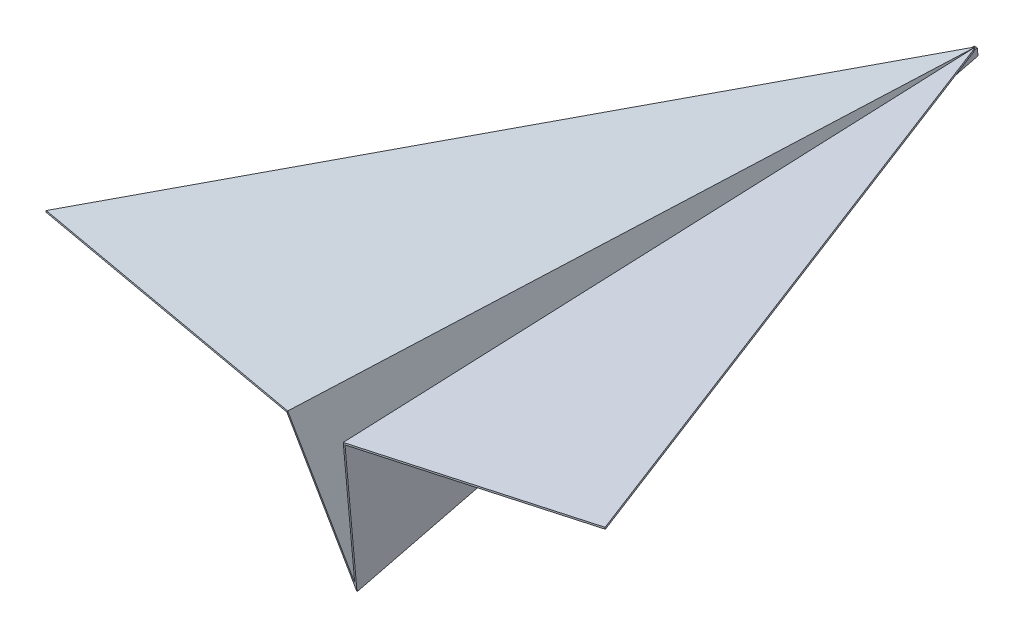
ISO-10303-21;
HEADER;
FILE_DESCRIPTION(('STEP AP214'),'2;1');
FILE_NAME('part.step','',(''),(''),'','','');
FILE_SCHEMA(('AUTOMOTIVE_DESIGN { 1 0 10303 214 1 1 1 1 }'));
ENDSEC;
DATA;
#1=APPLICATION_CONTEXT('core data for automotive mechanical design processes');
#2=APPLICATION_PROTOCOL_DEFINITION('international standard','automotive_design',2000,#1);
#3=PRODUCT_CONTEXT('',#1,'mechanical');
#4=PRODUCT('Part','Part','',(#3));
#5=PRODUCT_RELATED_PRODUCT_CATEGORY('part','',(#4));
#6=PRODUCT_DEFINITION_FORMATION('','',#4);
#7=PRODUCT_DEFINITION_CONTEXT('part definition',#1,'design');
#8=PRODUCT_DEFINITION('design','',#6,#7);
#9=PRODUCT_DEFINITION_SHAPE('','',#8);
#10=(LENGTH_UNIT() NAMED_UNIT(*) SI_UNIT(.MILLI.,.METRE.));
#11=(NAMED_UNIT(*) PLANE_ANGLE_UNIT() SI_UNIT($,.RADIAN.));
#12=(NAMED_UNIT(*) SI_UNIT($,.STERADIAN.) SOLID_ANGLE_UNIT());
#13=UNCERTAINTY_MEASURE_WITH_UNIT(LENGTH_MEASURE(1.E-05),#10,'distance_accuracy_value','');
#14=(GEOMETRIC_REPRESENTATION_CONTEXT(3) GLOBAL_UNCERTAINTY_ASSIGNED_CONTEXT((#13)) GLOBAL_UNIT_ASSIGNED_CONTEXT((#10,
#11,#12)) REPRESENTATION_CONTEXT('',''));
#15=CARTESIAN_POINT('',(0.,0.,0.));
#16=DIRECTION('',(0.,0.,1.));
#17=DIRECTION('',(1.,0.,0.));
#18=AXIS2_PLACEMENT_3D('',#15,#16,#17);
#19=CARTESIAN_POINT('',(86.9910760611707,14.8972842107196,202.757548833242));
#20=DIRECTION('',(0.900802991421506,0.171191018769699,-0.399058398907551));
#21=DIRECTION('',(-0.393387244085793,-0.0673678478916255,-0.916901330166467));
#22=AXIS2_PLACEMENT_3D('',#19,#20,#21);
#23=PLANE('',#22);
#24=DIRECTION('',(-0.413760082318396,0.0595692070179401,-0.908434975028553));
#25=VECTOR('',#24,1.);
#26=CARTESIAN_POINT('',(90.7367850940264,-13.0634117847286,199.218031471757));
#27=LINE('',#26,#25);
#28=CARTESIAN_POINT('',(0.,0.,0.));
#29=VERTEX_POINT('',#28);
#30=CARTESIAN_POINT('',(0.542832099310203,-0.0781517577012582,1.19182029793317));
#31=VERTEX_POINT('',#30);
#32=EDGE_CURVE('E144',#29,#31,#27,.F.);
#33=ORIENTED_EDGE('',*,*,#32,.F.);
#34=DIRECTION('',(-0.393387244085793,-0.0673678478916255,-0.916901330166467));
#35=VECTOR('',#34,1.);
#36=CARTESIAN_POINT('',(86.9910760611707,14.8972842107196,202.757548833242));
#37=LINE('',#36,#35);
#38=CARTESIAN_POINT('',(86.9910760611707,14.8972842107196,202.757548833242));
#39=VERTEX_POINT('',#38);
#40=EDGE_CURVE('E187',#39,#29,#37,.T.);
#41=ORIENTED_EDGE('',*,*,#40,.F.);
#42=DIRECTION('',(-0.183848978339969,0.982931944827842,0.00665920417964591));
#43=VECTOR('',#42,1.);
#44=CARTESIAN_POINT('',(86.9910760611707,14.8972842107196,202.757548833242));
#45=LINE('',#44,#43);
#46=CARTESIAN_POINT('',(87.0830005503407,14.4058182383057,202.754219231153));
#47=VERTEX_POINT('',#46);
#48=EDGE_CURVE('E229',#47,#39,#45,.T.);
#49=ORIENTED_EDGE('',*,*,#48,.F.);
#50=DIRECTION('',(-0.393387244085793,-0.0673678478916255,-0.916901330166467));
#51=VECTOR('',#50,1.);
#52=CARTESIAN_POINT('',(87.0830005503407,14.4058182383057,202.754219231153));
#53=LINE('',#52,#51);
#54=CARTESIAN_POINT('',(0.474633754561962,-0.425926736037412,0.888683648925575));
#55=VERTEX_POINT('',#54);
#56=EDGE_CURVE('E214',#47,#55,#53,.T.);
#57=ORIENTED_EDGE('',*,*,#56,.T.);
#58=DIRECTION('',(0.1462358689262,0.745724494274892,0.65000773016777));
#59=VECTOR('',#58,1.);
#60=CARTESIAN_POINT('',(23.1843364853998,115.381376276835,101.831649511195));
#61=LINE('',#60,#59);
#62=EDGE_CURVE('E189',#55,#31,#61,.T.);
#63=ORIENTED_EDGE('',*,*,#62,.T.);
#64=EDGE_LOOP('',(#33,#41,#49,#57,#63));
#65=FACE_BOUND('',#64,.T.);
#66=ADVANCED_FACE('F48',(#65),#23,.T.);
#67=CARTESIAN_POINT('',(0.,0.,0.));
#68=DIRECTION('',(-0.982105057454934,-0.18396747115991,0.0403190485560796));
#69=DIRECTION('',(0.0408559577637024,0.000872577781219575,0.999164665769975));
#70=AXIS2_PLACEMENT_3D('',#67,#68,#69);
#71=PLANE('',#70);
#72=DIRECTION('',(-0.169600271682268,0.956992114317288,0.235375956673208));
#73=VECTOR('',#72,1.);
#74=CARTESIAN_POINT('',(16.4324047650563,-45.0161000811578,194.866942893464));
#75=LINE('',#74,#73);
#76=CARTESIAN_POINT('',(8.5097883546625,-0.311682132396206,205.862169483931));
#77=VERTEX_POINT('',#76);
#78=CARTESIAN_POINT('',(8.42267146477595,0.179886517926775,205.983072717729));
#79=VERTEX_POINT('',#78);
#80=EDGE_CURVE('E192',#77,#79,#75,.T.);
#81=ORIENTED_EDGE('',*,*,#80,.F.);
#82=DIRECTION('',(0.0408559577637024,0.000872577781219575,0.999164665769975));
#83=VECTOR('',#82,1.);
#84=CARTESIAN_POINT('',(0.0919244891699846,-0.491465972413921,-0.00332960208982294));
#85=LINE('',#84,#83);
#86=CARTESIAN_POINT('',(8.51459595394593,-0.311579454487149,205.979743115639));
#87=VERTEX_POINT('',#86);
#88=EDGE_CURVE('E191',#77,#87,#85,.T.);
#89=ORIENTED_EDGE('',*,*,#88,.T.);
#90=DIRECTION('',(-0.183848978339969,0.982931944827842,0.00665920417964591));
#91=VECTOR('',#90,1.);
#92=CARTESIAN_POINT('',(8.42267146477595,0.179886517926775,205.983072717729));
#93=LINE('',#92,#91);
#94=EDGE_CURVE('E203',#87,#79,#93,.T.);
#95=ORIENTED_EDGE('',*,*,#94,.T.);
#96=EDGE_LOOP('',(#81,#89,#95));
#97=FACE_BOUND('',#96,.T.);
#98=ADVANCED_FACE('F275',(#97),#71,.T.);
#99=CARTESIAN_POINT('',(8.42267146477595,0.179886517926775,205.983072717729));
#100=DIRECTION('',(0.0408559577637023,0.000872577781219547,0.999164665769976));
#101=DIRECTION('',(0.982105057454934,0.18396747115991,-0.0403190485560795));
#102=AXIS2_PLACEMENT_3D('',#99,#100,#101);
#103=PLANE('',#102);
#104=DIRECTION('',(0.982105057454934,0.18396747115991,-0.0403190485560795));
#105=VECTOR('',#104,1.);
#106=CARTESIAN_POINT('',(8.51459595394594,-0.311579454487156,205.979743115639));
#107=LINE('',#106,#105);
#108=EDGE_CURVE('E220',#87,#47,#107,.T.);
#109=ORIENTED_EDGE('',*,*,#108,.T.);
#110=ORIENTED_EDGE('',*,*,#48,.T.);
#111=DIRECTION('',(0.982105057454934,0.18396747115991,-0.0403190485560795));
#112=VECTOR('',#111,1.);
#113=CARTESIAN_POINT('',(8.42267146477595,0.179886517926775,205.983072717729));
#114=LINE('',#113,#112);
#115=EDGE_CURVE('E201',#79,#39,#114,.T.);
#116=ORIENTED_EDGE('',*,*,#115,.F.);
#117=ORIENTED_EDGE('',*,*,#94,.F.);
#118=EDGE_LOOP('',(#109,#110,#116,#117));
#119=FACE_BOUND('',#118,.T.);
#120=ADVANCED_FACE('F50',(#119),#103,.T.);
#121=CARTESIAN_POINT('',(0.,0.,0.));
#122=DIRECTION('',(-0.183848978339969,0.982931944827842,0.00665920417964591));
#123=DIRECTION('',(-0.0011817069281873,-0.00699569509945222,0.999974831592681));
#124=AXIS2_PLACEMENT_3D('',#121,#122,#123);
#125=PLANE('',#124);
#126=DIRECTION('',(0.0408559577637024,0.000872577781219575,0.999164665769975));
#127=VECTOR('',#126,1.);
#128=CARTESIAN_POINT('',(0.,0.,0.));
#129=LINE('',#128,#127);
#130=EDGE_CURVE('E199',#29,#79,#129,.T.);
#131=ORIENTED_EDGE('',*,*,#130,.T.);
#132=ORIENTED_EDGE('',*,*,#115,.T.);
#133=ORIENTED_EDGE('',*,*,#40,.T.);
#134=EDGE_LOOP('',(#131,#132,#133));
#135=FACE_BOUND('',#134,.T.);
#136=ADVANCED_FACE('F197',(#135),#125,.T.);
#137=CARTESIAN_POINT('',(0.0919244891699833,-0.491465972413914,-0.00332960208982291));
#138=DIRECTION('',(-0.183848978339969,0.982931944827842,0.00665920417964591));
#139=DIRECTION('',(-0.0011817069281873,-0.00699569509945222,0.999974831592681));
#140=AXIS2_PLACEMENT_3D('',#137,#138,#139);
#141=PLANE('',#140);
#142=ORIENTED_EDGE('',*,*,#88,.F.);
#143=DIRECTION('',(0.982064202668406,0.183389969142328,0.0437952172644891));
#144=VECTOR('',#143,1.);
#145=CARTESIAN_POINT('',(-8.49541694590631,-3.48722204807244,205.103821242805));
#146=LINE('',#145,#144);
#147=CARTESIAN_POINT('',(8.85665560743876,-0.246908388876907,205.877638051725));
#148=VERTEX_POINT('',#147);
#149=EDGE_CURVE('E57',#77,#148,#146,.T.);
#150=ORIENTED_EDGE('',*,*,#149,.T.);
#151=DIRECTION('',(0.0408559577637024,0.000872577781219575,0.999164665769976));
#152=VECTOR('',#151,1.);
#153=CARTESIAN_POINT('',(0.437578983488006,-0.426718130284344,-0.0175199987630169));
#154=LINE('',#153,#152);
#155=EDGE_CURVE('E232',#55,#148,#154,.T.);
#156=ORIENTED_EDGE('',*,*,#155,.F.);
#157=ORIENTED_EDGE('',*,*,#56,.F.);
#158=ORIENTED_EDGE('',*,*,#108,.F.);
#159=EDGE_LOOP('',(#142,#150,#156,#157,#158));
#160=FACE_BOUND('',#159,.T.);
#161=ADVANCED_FACE('F243',(#160),#141,.F.);
#162=CARTESIAN_POINT('',(0.,0.,0.));
#163=DIRECTION('',(-0.158252861548158,-0.987371386644425,0.00733325628118373));
#164=DIRECTION('',(0.0408559577637024,0.000872577781219602,0.999164665769976));
#165=AXIS2_PLACEMENT_3D('',#162,#163,#164);
#166=PLANE('',#165);
#167=DIRECTION('',(-0.986553000363909,0.158420274724802,0.0402019157390316));
#168=VECTOR('',#167,1.);
#169=CARTESIAN_POINT('',(0.,0.,0.));
#170=LINE('',#169,#168);
#171=CARTESIAN_POINT('',(0.493276500181954,-0.0792101373624008,-0.0201009578695158));
#172=VERTEX_POINT('',#171);
#173=EDGE_CURVE('E64',#29,#172,#170,.F.);
#174=ORIENTED_EDGE('',*,*,#173,.F.);
#175=ORIENTED_EDGE('',*,*,#32,.T.);
#176=DIRECTION('',(0.0408559577637024,0.000872577781219602,0.999164665769976));
#177=VECTOR('',#176,1.);
#178=CARTESIAN_POINT('',(0.493276500181954,-0.0792101373624008,-0.0201009578695158));
#179=LINE('',#178,#177);
#180=EDGE_CURVE('E71',#172,#31,#179,.T.);
#181=ORIENTED_EDGE('',*,*,#180,.F.);
#182=EDGE_LOOP('',(#174,#175,#181));
#183=FACE_BOUND('',#182,.T.);
#184=ADVANCED_FACE('F142',(#183),#166,.F.);
#185=CARTESIAN_POINT('',(-8.94120087495242,0.,205.961294730136));
#186=DIRECTION('',(0.00125414432133979,-0.238626211612553,0.971110682802667));
#187=DIRECTION('',(0.183840594784407,-0.954504846450211,-0.234783163392042));
#188=AXIS2_PLACEMENT_3D('',#185,#186,#187);
#189=PLANE('',#188);
#190=DIRECTION('',(0.14914661360163,0.960294273315689,0.235775733035143));
#191=VECTOR('',#190,1.);
#192=CARTESIAN_POINT('',(-8.94120087495241,0.,205.961294730136));
#193=LINE('',#192,#191);
#194=CARTESIAN_POINT('',(-9.01781153710056,-0.493264837593176,205.840186147178));
#195=VERTEX_POINT('',#194);
#196=CARTESIAN_POINT('',(-8.94120087495242,0.,205.961294730136));
#197=VERTEX_POINT('',#196);
#198=EDGE_CURVE('E498',#195,#197,#193,.T.);
#199=ORIENTED_EDGE('',*,*,#198,.F.);
#200=DIRECTION('',(-0.985759538566655,0.163003677779516,0.041327147920063));
#201=VECTOR('',#200,1.);
#202=CARTESIAN_POINT('',(-9.02756007199477,-0.491652834890124,205.840594846386));
#203=LINE('',#202,#201);
#204=CARTESIAN_POINT('',(-9.36598399070548,-0.435691577362125,205.85478298741));
#205=VERTEX_POINT('',#204);
#206=EDGE_CURVE('E181',#195,#205,#203,.T.);
#207=ORIENTED_EDGE('',*,*,#206,.T.);
#208=DIRECTION('',(0.183840594784407,-0.954504846450211,-0.234783163392042));
#209=VECTOR('',#208,1.);
#210=CARTESIAN_POINT('',(-0.24064877073475,-47.8146543312601,194.200800511613));
#211=LINE('',#210,#209);
#212=CARTESIAN_POINT('',(0.280657140719506,-50.5212873224651,193.535039768564));
#213=VERTEX_POINT('',#212);
#214=EDGE_CURVE('E258',#205,#213,#211,.T.);
#215=ORIENTED_EDGE('',*,*,#214,.T.);
#216=DIRECTION('',(-0.16343685201016,-0.958102576808746,-0.235218723143906));
#217=VECTOR('',#216,1.);
#218=CARTESIAN_POINT('',(0.744105364449891,-47.804452459873,194.202035602664));
#219=LINE('',#218,#217);
#220=EDGE_CURVE('E252',#148,#213,#219,.T.);
#221=ORIENTED_EDGE('',*,*,#220,.F.);
#222=ORIENTED_EDGE('',*,*,#149,.F.);
#223=ORIENTED_EDGE('',*,*,#80,.T.);
#224=DIRECTION('',(-0.16343685201016,-0.958102576808746,-0.235218723143906));
#225=VECTOR('',#224,1.);
#226=CARTESIAN_POINT('',(8.42267146477596,0.179886517926782,205.983072717729));
#227=LINE('',#226,#225);
#228=CARTESIAN_POINT('',(0.250828864267937,-47.7252423225105,194.222136560533));
#229=VERTEX_POINT('',#228);
#230=EDGE_CURVE('E210',#79,#229,#227,.T.);
#231=ORIENTED_EDGE('',*,*,#230,.T.);
#232=DIRECTION('',(0.183840594784407,-0.954504846450211,-0.234783163392042));
#233=VECTOR('',#232,1.);
#234=CARTESIAN_POINT('',(-8.94120087495242,0.,205.961294730136));
#235=LINE('',#234,#233);
#236=EDGE_CURVE('E164',#197,#229,#235,.T.);
#237=ORIENTED_EDGE('',*,*,#236,.F.);
#238=EDGE_LOOP('',(#199,#207,#215,#221,#222,#223,#231,#237));
#239=FACE_BOUND('',#238,.T.);
#240=ADVANCED_FACE('F255',(#239),#189,.T.);
#241=CARTESIAN_POINT('',(0.,0.,0.));
#242=DIRECTION('',(-0.178655748929211,0.983881075519547,-0.00775581130781969));
#243=DIRECTION('',(-0.0433711948556398,0.,0.999059027013317));
#244=AXIS2_PLACEMENT_3D('',#241,#242,#243);
#245=PLANE('',#244);
#246=DIRECTION('',(0.982955270005374,0.178824017499048,0.0426720978411347));
#247=VECTOR('',#246,1.);
#248=CARTESIAN_POINT('',(0.,0.,0.));
#249=LINE('',#248,#247);
#250=CARTESIAN_POINT('',(-0.491477635002687,-0.0894120087495241,-0.0213360489205674));
#251=VERTEX_POINT('',#250);
#252=EDGE_CURVE('E130',#251,#29,#249,.T.);
#253=ORIENTED_EDGE('',*,*,#252,.F.);
#254=DIRECTION('',(-0.0433711948556398,0.,0.999059027013317));
#255=VECTOR('',#254,1.);
#256=CARTESIAN_POINT('',(-0.491477635002687,-0.0894120087495241,-0.0213360489205674));
#257=LINE('',#256,#255);
#258=CARTESIAN_POINT('',(-0.544084051878534,-0.0894120087495241,1.19045707399374));
#259=VERTEX_POINT('',#258);
#260=EDGE_CURVE('E179',#251,#259,#257,.T.);
#261=ORIENTED_EDGE('',*,*,#260,.T.);
#262=DIRECTION('',(-0.414714351600534,-0.0681520494964598,0.907395891949033));
#263=VECTOR('',#262,1.);
#264=CARTESIAN_POINT('',(0.,0.,0.));
#265=LINE('',#264,#263);
#266=EDGE_CURVE('E170',#29,#259,#265,.T.);
#267=ORIENTED_EDGE('',*,*,#266,.F.);
#268=EDGE_LOOP('',(#253,#261,#267));
#269=FACE_BOUND('',#268,.T.);
#270=ADVANCED_FACE('F178',(#269),#245,.T.);
#271=CARTESIAN_POINT('',(-0.491477635002687,-0.0894120087495241,-0.0213360489205674));
#272=DIRECTION('',(0.982955270005374,0.178824017499048,0.0426720978411347));
#273=DIRECTION('',(0.183840594784407,-0.954504846450211,-0.234783163392042));
#274=AXIS2_PLACEMENT_3D('',#271,#272,#273);
#275=PLANE('',#274);
#276=ORIENTED_EDGE('',*,*,#260,.F.);
#277=DIRECTION('',(0.183840594784407,-0.954504846450211,-0.234783163392042));
#278=VECTOR('',#277,1.);
#279=CARTESIAN_POINT('',(-0.491477635002687,-0.0894120087495241,-0.0213360489205674));
#280=LINE('',#279,#278);
#281=CARTESIAN_POINT('',(0.029828276451569,-2.79604499995456,-0.687096791969376));
#282=VERTEX_POINT('',#281);
#283=EDGE_CURVE('E133',#251,#282,#280,.T.);
#284=ORIENTED_EDGE('',*,*,#283,.T.);
#285=DIRECTION('',(-0.00125414432133968,0.238626211612553,-0.971110682802667));
#286=VECTOR('',#285,1.);
#287=CARTESIAN_POINT('',(0.0298282764515691,-2.79604499995456,-0.687096791969376));
#288=LINE('',#287,#286);
#289=EDGE_CURVE('E260',#213,#282,#288,.T.);
#290=ORIENTED_EDGE('',*,*,#289,.F.);
#291=ORIENTED_EDGE('',*,*,#214,.F.);
#292=DIRECTION('',(-0.0433711948556398,0.,0.999059027013317));
#293=VECTOR('',#292,1.);
#294=CARTESIAN_POINT('',(-0.428599267678969,-0.435691577362149,-0.0186063704454585));
#295=LINE('',#294,#293);
#296=CARTESIAN_POINT('',(-0.467935261363773,-0.435691577362154,0.887501466982922));
#297=VERTEX_POINT('',#296);
#298=EDGE_CURVE('E12',#297,#205,#295,.T.);
#299=ORIENTED_EDGE('',*,*,#298,.F.);
#300=DIRECTION('',(-0.163283795079086,0.742517927588705,0.64961952670309));
#301=VECTOR('',#300,1.);
#302=CARTESIAN_POINT('',(-0.414143746577203,-0.680303506315809,0.673493589720117));
#303=LINE('',#302,#301);
#304=EDGE_CURVE('E182',#297,#259,#303,.T.);
#305=ORIENTED_EDGE('',*,*,#304,.T.);
#306=EDGE_LOOP('',(#276,#284,#290,#291,#299,#305));
#307=FACE_BOUND('',#306,.T.);
#308=ADVANCED_FACE('F293',(#307),#275,.F.);
#309=CARTESIAN_POINT('',(0.493276500181954,-0.0792101373624008,-0.0201009578695158));
#310=DIRECTION('',(-0.986553000363909,0.158420274724802,0.0402019157390316));
#311=DIRECTION('',(-0.16343685201016,-0.958102576808746,-0.235218723143906));
#312=AXIS2_PLACEMENT_3D('',#309,#310,#311);
#313=PLANE('',#312);
#314=ORIENTED_EDGE('',*,*,#289,.T.);
#315=DIRECTION('',(0.16343685201016,0.958102576808746,0.235218723143906));
#316=VECTOR('',#315,1.);
#317=CARTESIAN_POINT('',(0.493276500181954,-0.0792101373624008,-0.0201009578695158));
#318=LINE('',#317,#316);
#319=EDGE_CURVE('E520',#282,#172,#318,.T.);
#320=ORIENTED_EDGE('',*,*,#319,.T.);
#321=ORIENTED_EDGE('',*,*,#180,.T.);
#322=ORIENTED_EDGE('',*,*,#62,.F.);
#323=ORIENTED_EDGE('',*,*,#155,.T.);
#324=ORIENTED_EDGE('',*,*,#220,.T.);
#325=EDGE_LOOP('',(#314,#320,#321,#322,#323,#324));
#326=FACE_BOUND('',#325,.T.);
#327=ADVANCED_FACE('F251',(#326),#313,.F.);
#328=CARTESIAN_POINT('',(0.,0.,0.));
#329=DIRECTION('',(0.982955270005374,0.178824017499048,0.0426720978411347));
#330=DIRECTION('',(0.183840594784407,-0.954504846450211,-0.234783163392042));
#331=AXIS2_PLACEMENT_3D('',#328,#329,#330);
#332=PLANE('',#331);
#333=DIRECTION('',(-0.00125414432133969,0.238626211612553,-0.971110682802667));
#334=VECTOR('',#333,1.);
#335=CARTESIAN_POINT('',(0.250828864267937,-47.7252423225105,194.222136560533));
#336=LINE('',#335,#334);
#337=EDGE_CURVE('E165',#229,#29,#336,.T.);
#338=ORIENTED_EDGE('',*,*,#337,.T.);
#339=DIRECTION('',(-0.0433711948556398,0.,0.999059027013317));
#340=VECTOR('',#339,1.);
#341=CARTESIAN_POINT('',(0.,0.,0.));
#342=LINE('',#341,#340);
#343=EDGE_CURVE('E152',#29,#197,#342,.T.);
#344=ORIENTED_EDGE('',*,*,#343,.T.);
#345=ORIENTED_EDGE('',*,*,#236,.T.);
#346=EDGE_LOOP('',(#338,#344,#345));
#347=FACE_BOUND('',#346,.T.);
#348=ADVANCED_FACE('F205',(#347),#332,.T.);
#349=CARTESIAN_POINT('',(0.,0.,0.));
#350=DIRECTION('',(-0.986553000363909,0.158420274724802,0.0402019157390316));
#351=DIRECTION('',(-0.16343685201016,-0.958102576808746,-0.235218723143906));
#352=AXIS2_PLACEMENT_3D('',#349,#350,#351);
#353=PLANE('',#352);
#354=ORIENTED_EDGE('',*,*,#337,.F.);
#355=ORIENTED_EDGE('',*,*,#230,.F.);
#356=ORIENTED_EDGE('',*,*,#130,.F.);
#357=EDGE_LOOP('',(#354,#355,#356));
#358=FACE_BOUND('',#357,.T.);
#359=ADVANCED_FACE('F212',(#358),#353,.T.);
#360=CARTESIAN_POINT('',(-87.7893110678696,13.086591605557,202.538337068265));
#361=DIRECTION('',(-0.903152549442342,0.152502371767947,-0.4013209426892));
#362=DIRECTION('',(0.396996987563356,-0.0591796128900197,-0.915910020298833));
#363=AXIS2_PLACEMENT_3D('',#360,#361,#362);
#364=PLANE('',#363);
#365=DIRECTION('',(0.396996987563356,-0.0591796128900197,-0.915910020298833));
#366=VECTOR('',#365,1.);
#367=CARTESIAN_POINT('',(-87.7893110678696,13.086591605557,202.538337068265));
#368=LINE('',#367,#366);
#369=CARTESIAN_POINT('',(-87.7893110678696,13.086591605557,202.538337068265));
#370=VERTEX_POINT('',#369);
#371=EDGE_CURVE('E155',#370,#29,#368,.T.);
#372=ORIENTED_EDGE('',*,*,#371,.T.);
#373=ORIENTED_EDGE('',*,*,#266,.T.);
#374=ORIENTED_EDGE('',*,*,#304,.F.);
#375=DIRECTION('',(0.396996987563356,-0.0591796128900197,-0.915910020298833));
#376=VECTOR('',#375,1.);
#377=CARTESIAN_POINT('',(-87.8710253020969,12.5933267679638,202.534789686299));
#378=LINE('',#377,#376);
#379=CARTESIAN_POINT('',(-87.8710253020969,12.5933267679638,202.534789686299));
#380=VERTEX_POINT('',#379);
#381=EDGE_CURVE('E514',#380,#297,#378,.T.);
#382=ORIENTED_EDGE('',*,*,#381,.F.);
#383=DIRECTION('',(0.163428468454605,0.986529675186377,0.00709476393150985));
#384=VECTOR('',#383,1.);
#385=CARTESIAN_POINT('',(-87.7893110678696,13.086591605557,202.538337068265));
#386=LINE('',#385,#384);
#387=EDGE_CURVE('E174',#380,#370,#386,.T.);
#388=ORIENTED_EDGE('',*,*,#387,.T.);
#389=EDGE_LOOP('',(#372,#373,#374,#382,#388));
#390=FACE_BOUND('',#389,.T.);
#391=ADVANCED_FACE('F169',(#390),#364,.T.);
#392=CARTESIAN_POINT('',(0.,0.,0.));
#393=DIRECTION('',(0.985601377411465,-0.163582395069462,0.0427869707733794));
#394=DIRECTION('',(-0.0433711948556398,0.,0.999059027013316));
#395=AXIS2_PLACEMENT_3D('',#392,#393,#394);
#396=PLANE('',#395);
#397=DIRECTION('',(-0.0433711948556398,0.,0.999059027013316));
#398=VECTOR('',#397,1.);
#399=CARTESIAN_POINT('',(-0.0817142342273025,-0.493264837593189,-0.00354738196575492));
#400=LINE('',#399,#398);
#401=CARTESIAN_POINT('',(-9.02291510917971,-0.493264837593169,205.95774734817));
#402=VERTEX_POINT('',#401);
#403=EDGE_CURVE('E146',#195,#402,#400,.T.);
#404=ORIENTED_EDGE('',*,*,#403,.F.);
#405=ORIENTED_EDGE('',*,*,#198,.T.);
#406=DIRECTION('',(0.163428468454605,0.986529675186377,0.00709476393150985));
#407=VECTOR('',#406,1.);
#408=CARTESIAN_POINT('',(-8.94120087495242,0.,205.961294730136));
#409=LINE('',#408,#407);
#410=EDGE_CURVE('E176',#402,#197,#409,.T.);
#411=ORIENTED_EDGE('',*,*,#410,.F.);
#412=EDGE_LOOP('',(#404,#405,#411));
#413=FACE_BOUND('',#412,.T.);
#414=ADVANCED_FACE('F310',(#413),#396,.T.);
#415=CARTESIAN_POINT('',(-8.94120087495242,0.,205.961294730136));
#416=DIRECTION('',(-0.0433711948556397,0.,0.999059027013317));
#417=DIRECTION('',(-0.985601377411465,0.163582395069462,-0.0427869707733793));
#418=AXIS2_PLACEMENT_3D('',#415,#416,#417);
#419=PLANE('',#418);
#420=ORIENTED_EDGE('',*,*,#410,.T.);
#421=DIRECTION('',(-0.985601377411465,0.163582395069462,-0.0427869707733793));
#422=VECTOR('',#421,1.);
#423=CARTESIAN_POINT('',(-8.94120087495242,0.,205.961294730136));
#424=LINE('',#423,#422);
#425=EDGE_CURVE('E157',#197,#370,#424,.T.);
#426=ORIENTED_EDGE('',*,*,#425,.T.);
#427=ORIENTED_EDGE('',*,*,#387,.F.);
#428=DIRECTION('',(-0.985601377411465,0.163582395069462,-0.0427869707733793));
#429=VECTOR('',#428,1.);
#430=CARTESIAN_POINT('',(-9.02291510917972,-0.493264837593176,205.95774734817));
#431=LINE('',#430,#429);
#432=EDGE_CURVE('E500',#402,#380,#431,.T.);
#433=ORIENTED_EDGE('',*,*,#432,.F.);
#434=EDGE_LOOP('',(#420,#426,#427,#433));
#435=FACE_BOUND('',#434,.T.);
#436=ADVANCED_FACE('F307',(#435),#419,.T.);
#437=CARTESIAN_POINT('',(0.,0.,0.));
#438=DIRECTION('',(0.163428468454605,0.986529675186377,0.00709476393150985));
#439=DIRECTION('',(-0.0011817069281873,-0.00699569509945222,0.999974831592681));
#440=AXIS2_PLACEMENT_3D('',#437,#438,#439);
#441=PLANE('',#440);
#442=ORIENTED_EDGE('',*,*,#343,.F.);
#443=ORIENTED_EDGE('',*,*,#371,.F.);
#444=ORIENTED_EDGE('',*,*,#425,.F.);
#445=EDGE_LOOP('',(#442,#443,#444));
#446=FACE_BOUND('',#445,.T.);
#447=ADVANCED_FACE('F154',(#446),#441,.T.);
#448=CARTESIAN_POINT('',(-0.0817142342273013,-0.493264837593182,-0.00354738196575487));
#449=DIRECTION('',(0.163428468454605,0.986529675186377,0.00709476393150985));
#450=DIRECTION('',(-0.0011817069281873,-0.00699569509945222,0.999974831592681));
#451=AXIS2_PLACEMENT_3D('',#448,#449,#450);
#452=PLANE('',#451);
#453=ORIENTED_EDGE('',*,*,#206,.F.);
#454=ORIENTED_EDGE('',*,*,#403,.T.);
#455=ORIENTED_EDGE('',*,*,#432,.T.);
#456=ORIENTED_EDGE('',*,*,#381,.T.);
#457=ORIENTED_EDGE('',*,*,#298,.T.);
#458=EDGE_LOOP('',(#453,#454,#455,#456,#457));
#459=FACE_BOUND('',#458,.T.);
#460=ADVANCED_FACE('F317',(#459),#452,.F.);
#461=CARTESIAN_POINT('',(0.,0.,0.));
#462=DIRECTION('',(0.00125414432133968,-0.238626211612553,0.971110682802667));
#463=DIRECTION('',(0.999945555031017,0.0103592516975208,0.00125414432133969));
#464=AXIS2_PLACEMENT_3D('',#461,#462,#463);
#465=PLANE('',#464);
#466=ORIENTED_EDGE('',*,*,#252,.T.);
#467=ORIENTED_EDGE('',*,*,#173,.T.);
#468=ORIENTED_EDGE('',*,*,#319,.F.);
#469=ORIENTED_EDGE('',*,*,#283,.F.);
#470=EDGE_LOOP('',(#466,#467,#468,#469));
#471=FACE_BOUND('',#470,.T.);
#472=ADVANCED_FACE('F131',(#471),#465,.F.);
#473=CLOSED_SHELL('',(#66,#98,#120,#136,#161,#184,#240,#270,#308,#327,#348,#359,#391,#414,#436,
#447,#460,#472));
#474=MANIFOLD_SOLID_BREP('B2',#473);
#475=ADVANCED_BREP_SHAPE_REPRESENTATION('',(#18,#474),#14);
#476=SHAPE_DEFINITION_REPRESENTATION(#9,#475);
ENDSEC;
END-ISO-10303-21;
